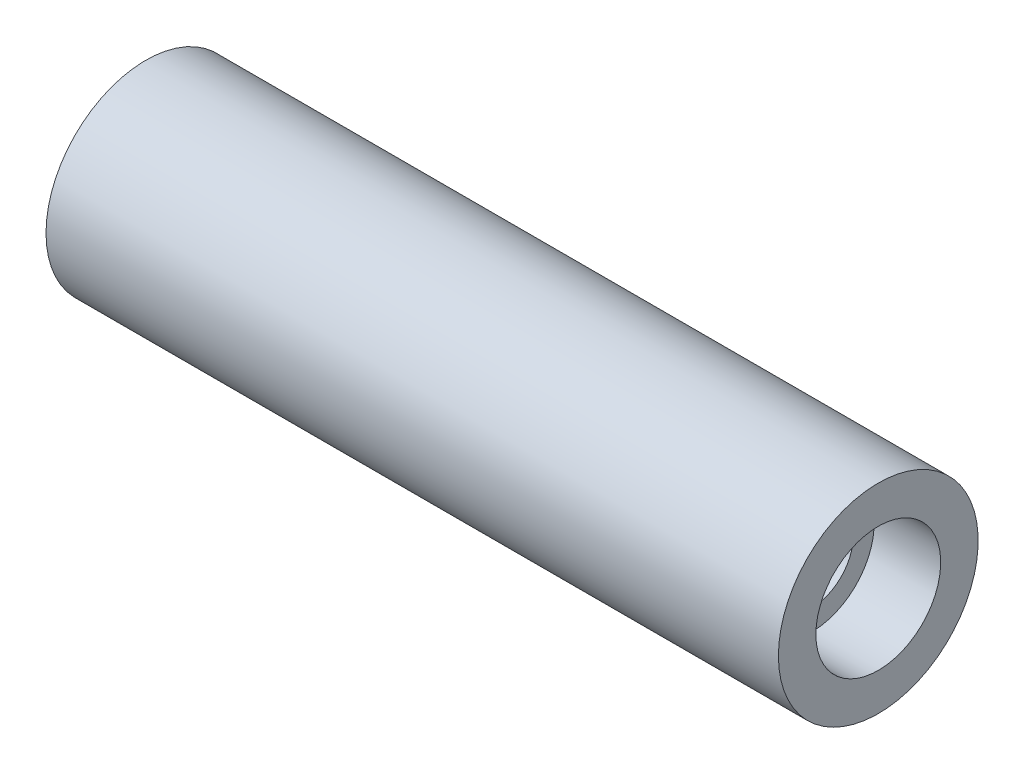
ISO-10303-21;
HEADER;
FILE_DESCRIPTION(('STEP AP214'),'2;1');
FILE_NAME('part.step','',(''),(''),'','','');
FILE_SCHEMA(('AUTOMOTIVE_DESIGN { 1 0 10303 214 1 1 1 1 }'));
ENDSEC;
DATA;
#1=APPLICATION_CONTEXT('core data for automotive mechanical design processes');
#2=APPLICATION_PROTOCOL_DEFINITION('international standard','automotive_design',2000,#1);
#3=PRODUCT_CONTEXT('',#1,'mechanical');
#4=PRODUCT('Part','Part','',(#3));
#5=PRODUCT_RELATED_PRODUCT_CATEGORY('part','',(#4));
#6=PRODUCT_DEFINITION_FORMATION('','',#4);
#7=PRODUCT_DEFINITION_CONTEXT('part definition',#1,'design');
#8=PRODUCT_DEFINITION('design','',#6,#7);
#9=PRODUCT_DEFINITION_SHAPE('','',#8);
#10=(LENGTH_UNIT() NAMED_UNIT(*) SI_UNIT(.MILLI.,.METRE.));
#11=(NAMED_UNIT(*) PLANE_ANGLE_UNIT() SI_UNIT($,.RADIAN.));
#12=(NAMED_UNIT(*) SI_UNIT($,.STERADIAN.) SOLID_ANGLE_UNIT());
#13=UNCERTAINTY_MEASURE_WITH_UNIT(LENGTH_MEASURE(1.E-05),#10,'distance_accuracy_value','');
#14=(GEOMETRIC_REPRESENTATION_CONTEXT(3) GLOBAL_UNCERTAINTY_ASSIGNED_CONTEXT((#13)) GLOBAL_UNIT_ASSIGNED_CONTEXT((#10,
#11,#12)) REPRESENTATION_CONTEXT('',''));
#15=CARTESIAN_POINT('',(0.,0.,0.));
#16=DIRECTION('',(0.,0.,1.));
#17=DIRECTION('',(1.,0.,0.));
#18=AXIS2_PLACEMENT_3D('',#15,#16,#17);
#19=CARTESIAN_POINT('',(0.,7.61999999999999,0.));
#20=DIRECTION('',(1.,0.,0.));
#21=DIRECTION('',(0.,0.,-1.));
#22=AXIS2_PLACEMENT_3D('',#19,#20,#21);
#23=PLANE('',#22);
#24=CARTESIAN_POINT('',(0.,0.,0.));
#25=DIRECTION('',(-1.,0.,0.));
#26=DIRECTION('',(0.,0.,1.));
#27=AXIS2_PLACEMENT_3D('',#24,#25,#26);
#28=CIRCLE('',#27,3.175);
#29=CARTESIAN_POINT('',(0.,0.,3.175));
#30=VERTEX_POINT('',#29);
#31=EDGE_CURVE('E10',#30,#30,#28,.T.);
#32=ORIENTED_EDGE('',*,*,#31,.F.);
#33=EDGE_LOOP('',(#32));
#34=FACE_BOUND('',#33,.T.);
#35=CARTESIAN_POINT('',(0.,0.,0.));
#36=DIRECTION('',(-1.,0.,0.));
#37=DIRECTION('',(0.,0.,1.));
#38=AXIS2_PLACEMENT_3D('',#35,#36,#37);
#39=CIRCLE('',#38,7.61999999999999);
#40=CARTESIAN_POINT('',(0.,0.,7.61999999999999));
#41=VERTEX_POINT('',#40);
#42=EDGE_CURVE('E52',#41,#41,#39,.T.);
#43=ORIENTED_EDGE('',*,*,#42,.T.);
#44=EDGE_LOOP('',(#43));
#45=FACE_BOUND('',#44,.T.);
#46=ADVANCED_FACE('F30',(#34,#45),#23,.F.);
#47=CARTESIAN_POINT('',(236.984173223983,0.,0.));
#48=DIRECTION('',(-1.,0.,0.));
#49=DIRECTION('',(0.,0.,1.));
#50=AXIS2_PLACEMENT_3D('',#47,#48,#49);
#51=CYLINDRICAL_SURFACE('',#50,3.175);
#52=CARTESIAN_POINT('',(50.8,0.,0.));
#53=DIRECTION('',(-1.,0.,0.));
#54=DIRECTION('',(0.,0.,1.));
#55=AXIS2_PLACEMENT_3D('',#52,#53,#54);
#56=CIRCLE('',#55,3.175);
#57=CARTESIAN_POINT('',(50.8,0.,3.175));
#58=VERTEX_POINT('',#57);
#59=EDGE_CURVE('E36',#58,#58,#56,.T.);
#60=ORIENTED_EDGE('',*,*,#59,.F.);
#61=EDGE_LOOP('',(#60));
#62=FACE_BOUND('',#61,.T.);
#63=ORIENTED_EDGE('',*,*,#31,.T.);
#64=EDGE_LOOP('',(#63));
#65=FACE_BOUND('',#64,.T.);
#66=ADVANCED_FACE('F77',(#62,#65),#51,.F.);
#67=CARTESIAN_POINT('',(50.8,3.175,0.));
#68=DIRECTION('',(-1.,0.,0.));
#69=DIRECTION('',(0.,0.,1.));
#70=AXIS2_PLACEMENT_3D('',#67,#68,#69);
#71=PLANE('',#70);
#72=CARTESIAN_POINT('',(50.8,0.,0.));
#73=DIRECTION('',(-1.,0.,0.));
#74=DIRECTION('',(0.,0.,1.));
#75=AXIS2_PLACEMENT_3D('',#72,#73,#74);
#76=CIRCLE('',#75,4.7625);
#77=CARTESIAN_POINT('',(50.8,0.,4.7625));
#78=VERTEX_POINT('',#77);
#79=EDGE_CURVE('E40',#78,#78,#76,.T.);
#80=ORIENTED_EDGE('',*,*,#79,.F.);
#81=EDGE_LOOP('',(#80));
#82=FACE_BOUND('',#81,.T.);
#83=ORIENTED_EDGE('',*,*,#59,.T.);
#84=EDGE_LOOP('',(#83));
#85=FACE_BOUND('',#84,.T.);
#86=ADVANCED_FACE('F72',(#82,#85),#71,.F.);
#87=CARTESIAN_POINT('',(236.984173223983,0.,0.));
#88=DIRECTION('',(-1.,0.,0.));
#89=DIRECTION('',(0.,0.,1.));
#90=AXIS2_PLACEMENT_3D('',#87,#88,#89);
#91=CYLINDRICAL_SURFACE('',#90,4.7625);
#92=CARTESIAN_POINT('',(55.88,0.,0.));
#93=DIRECTION('',(-1.,0.,0.));
#94=DIRECTION('',(0.,0.,1.));
#95=AXIS2_PLACEMENT_3D('',#92,#93,#94);
#96=CIRCLE('',#95,4.7625);
#97=CARTESIAN_POINT('',(55.88,0.,4.7625));
#98=VERTEX_POINT('',#97);
#99=EDGE_CURVE('E44',#98,#98,#96,.T.);
#100=ORIENTED_EDGE('',*,*,#99,.F.);
#101=EDGE_LOOP('',(#100));
#102=FACE_BOUND('',#101,.T.);
#103=ORIENTED_EDGE('',*,*,#79,.T.);
#104=EDGE_LOOP('',(#103));
#105=FACE_BOUND('',#104,.T.);
#106=ADVANCED_FACE('F66',(#102,#105),#91,.F.);
#107=CARTESIAN_POINT('',(55.88,4.7625,0.));
#108=DIRECTION('',(-1.,0.,0.));
#109=DIRECTION('',(0.,0.,1.));
#110=AXIS2_PLACEMENT_3D('',#107,#108,#109);
#111=PLANE('',#110);
#112=CARTESIAN_POINT('',(55.88,0.,0.));
#113=DIRECTION('',(-1.,0.,0.));
#114=DIRECTION('',(0.,0.,1.));
#115=AXIS2_PLACEMENT_3D('',#112,#113,#114);
#116=CIRCLE('',#115,7.62);
#117=CARTESIAN_POINT('',(55.88,0.,7.62));
#118=VERTEX_POINT('',#117);
#119=EDGE_CURVE('E49',#118,#118,#116,.T.);
#120=ORIENTED_EDGE('',*,*,#119,.F.);
#121=EDGE_LOOP('',(#120));
#122=FACE_BOUND('',#121,.T.);
#123=ORIENTED_EDGE('',*,*,#99,.T.);
#124=EDGE_LOOP('',(#123));
#125=FACE_BOUND('',#124,.T.);
#126=ADVANCED_FACE('F60',(#122,#125),#111,.F.);
#127=CARTESIAN_POINT('',(236.984173223983,0.,0.));
#128=DIRECTION('',(-1.,0.,0.));
#129=DIRECTION('',(0.,0.,1.));
#130=AXIS2_PLACEMENT_3D('',#127,#128,#129);
#131=CYLINDRICAL_SURFACE('',#130,7.61999999999999);
#132=ORIENTED_EDGE('',*,*,#42,.F.);
#133=EDGE_LOOP('',(#132));
#134=FACE_BOUND('',#133,.T.);
#135=ORIENTED_EDGE('',*,*,#119,.T.);
#136=EDGE_LOOP('',(#135));
#137=FACE_BOUND('',#136,.T.);
#138=ADVANCED_FACE('F57',(#134,#137),#131,.T.);
#139=CLOSED_SHELL('',(#46,#66,#86,#106,#126,#138));
#140=MANIFOLD_SOLID_BREP('B2',#139);
#141=ADVANCED_BREP_SHAPE_REPRESENTATION('',(#18,#140),#14);
#142=SHAPE_DEFINITION_REPRESENTATION(#9,#141);
ENDSEC;
END-ISO-10303-21;
